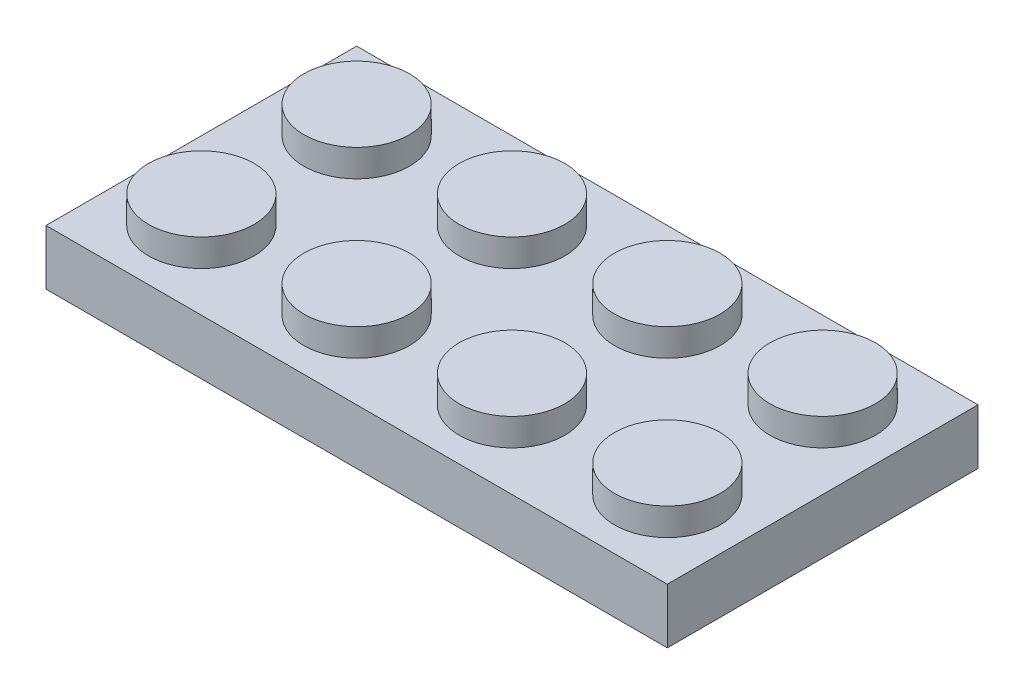
ISO-10303-21;
HEADER;
FILE_DESCRIPTION(('STEP AP214'),'2;1');
FILE_NAME('part.step','',(''),(''),'','','');
FILE_SCHEMA(('AUTOMOTIVE_DESIGN { 1 0 10303 214 1 1 1 1 }'));
ENDSEC;
DATA;
#1=APPLICATION_CONTEXT('core data for automotive mechanical design processes');
#2=APPLICATION_PROTOCOL_DEFINITION('international standard','automotive_design',2000,#1);
#3=PRODUCT_CONTEXT('',#1,'mechanical');
#4=PRODUCT('Part','Part','',(#3));
#5=PRODUCT_RELATED_PRODUCT_CATEGORY('part','',(#4));
#6=PRODUCT_DEFINITION_FORMATION('','',#4);
#7=PRODUCT_DEFINITION_CONTEXT('part definition',#1,'design');
#8=PRODUCT_DEFINITION('design','',#6,#7);
#9=PRODUCT_DEFINITION_SHAPE('','',#8);
#10=(LENGTH_UNIT() NAMED_UNIT(*) SI_UNIT(.MILLI.,.METRE.));
#11=(NAMED_UNIT(*) PLANE_ANGLE_UNIT() SI_UNIT($,.RADIAN.));
#12=(NAMED_UNIT(*) SI_UNIT($,.STERADIAN.) SOLID_ANGLE_UNIT());
#13=UNCERTAINTY_MEASURE_WITH_UNIT(LENGTH_MEASURE(1.E-05),#10,'distance_accuracy_value','');
#14=(GEOMETRIC_REPRESENTATION_CONTEXT(3) GLOBAL_UNCERTAINTY_ASSIGNED_CONTEXT((#13)) GLOBAL_UNIT_ASSIGNED_CONTEXT((#10,
#11,#12)) REPRESENTATION_CONTEXT('',''));
#15=CARTESIAN_POINT('',(0.,0.,0.));
#16=DIRECTION('',(0.,0.,1.));
#17=DIRECTION('',(1.,0.,0.));
#18=AXIS2_PLACEMENT_3D('',#15,#16,#17);
#19=CARTESIAN_POINT('',(-15.875,1.4097,7.9375));
#20=DIRECTION('',(0.,-1.,0.));
#21=DIRECTION('',(0.,0.,-1.));
#22=AXIS2_PLACEMENT_3D('',#19,#20,#21);
#23=PLANE('',#22);
#24=CARTESIAN_POINT('',(11.90625,1.4097,3.96875));
#25=DIRECTION('',(0.,-1.,0.));
#26=DIRECTION('',(0.,0.,-1.));
#27=AXIS2_PLACEMENT_3D('',#24,#25,#26);
#28=CIRCLE('',#27,2.69875);
#29=CARTESIAN_POINT('',(11.90625,1.4097,1.27));
#30=VERTEX_POINT('',#29);
#31=EDGE_CURVE('E194',#30,#30,#28,.F.);
#32=ORIENTED_EDGE('',*,*,#31,.F.);
#33=EDGE_LOOP('',(#32));
#34=FACE_BOUND('',#33,.T.);
#35=DIRECTION('',(0.,0.,1.));
#36=VECTOR('',#35,1.);
#37=CARTESIAN_POINT('',(-15.875,1.4097,-7.9375));
#38=LINE('',#37,#36);
#39=CARTESIAN_POINT('',(-15.875,1.4097,-7.9375));
#40=VERTEX_POINT('',#39);
#41=CARTESIAN_POINT('',(-15.875,1.4097,7.9375));
#42=VERTEX_POINT('',#41);
#43=EDGE_CURVE('E172',#40,#42,#38,.T.);
#44=ORIENTED_EDGE('',*,*,#43,.T.);
#45=DIRECTION('',(1.,0.,0.));
#46=VECTOR('',#45,1.);
#47=CARTESIAN_POINT('',(15.875,1.4097,7.9375));
#48=LINE('',#47,#46);
#49=CARTESIAN_POINT('',(15.875,1.4097,7.9375));
#50=VERTEX_POINT('',#49);
#51=EDGE_CURVE('E114',#42,#50,#48,.T.);
#52=ORIENTED_EDGE('',*,*,#51,.T.);
#53=DIRECTION('',(0.,0.,-1.));
#54=VECTOR('',#53,1.);
#55=CARTESIAN_POINT('',(15.875,1.4097,-7.9375));
#56=LINE('',#55,#54);
#57=CARTESIAN_POINT('',(15.875,1.4097,-7.9375));
#58=VERTEX_POINT('',#57);
#59=EDGE_CURVE('E175',#50,#58,#56,.T.);
#60=ORIENTED_EDGE('',*,*,#59,.T.);
#61=DIRECTION('',(-1.,0.,0.));
#62=VECTOR('',#61,1.);
#63=CARTESIAN_POINT('',(15.875,1.4097,-7.9375));
#64=LINE('',#63,#62);
#65=EDGE_CURVE('E85',#58,#40,#64,.T.);
#66=ORIENTED_EDGE('',*,*,#65,.T.);
#67=EDGE_LOOP('',(#44,#52,#60,#66));
#68=FACE_BOUND('',#67,.T.);
#69=CARTESIAN_POINT('',(3.96875,1.4097,3.96875000000001));
#70=DIRECTION('',(0.,-1.,0.));
#71=DIRECTION('',(0.,0.,-1.));
#72=AXIS2_PLACEMENT_3D('',#69,#70,#71);
#73=CIRCLE('',#72,2.69875);
#74=CARTESIAN_POINT('',(3.96875,1.4097,1.27000000000001));
#75=VERTEX_POINT('',#74);
#76=EDGE_CURVE('E197',#75,#75,#73,.F.);
#77=ORIENTED_EDGE('',*,*,#76,.F.);
#78=EDGE_LOOP('',(#77));
#79=FACE_BOUND('',#78,.T.);
#80=CARTESIAN_POINT('',(-3.96875,1.4097,3.96875000000001));
#81=DIRECTION('',(0.,-1.,0.));
#82=DIRECTION('',(0.,0.,-1.));
#83=AXIS2_PLACEMENT_3D('',#80,#81,#82);
#84=CIRCLE('',#83,2.69875);
#85=CARTESIAN_POINT('',(-3.96875,1.4097,1.27000000000001));
#86=VERTEX_POINT('',#85);
#87=EDGE_CURVE('E200',#86,#86,#84,.F.);
#88=ORIENTED_EDGE('',*,*,#87,.F.);
#89=EDGE_LOOP('',(#88));
#90=FACE_BOUND('',#89,.T.);
#91=CARTESIAN_POINT('',(-11.90625,1.4097,3.96875000000001));
#92=DIRECTION('',(0.,-1.,0.));
#93=DIRECTION('',(0.,0.,-1.));
#94=AXIS2_PLACEMENT_3D('',#91,#92,#93);
#95=CIRCLE('',#94,2.69875);
#96=CARTESIAN_POINT('',(-11.90625,1.4097,1.27000000000001));
#97=VERTEX_POINT('',#96);
#98=EDGE_CURVE('E206',#97,#97,#95,.F.);
#99=ORIENTED_EDGE('',*,*,#98,.F.);
#100=EDGE_LOOP('',(#99));
#101=FACE_BOUND('',#100,.T.);
#102=CARTESIAN_POINT('',(11.90625,1.4097,-3.96875));
#103=DIRECTION('',(0.,-1.,0.));
#104=DIRECTION('',(0.,0.,-1.));
#105=AXIS2_PLACEMENT_3D('',#102,#103,#104);
#106=CIRCLE('',#105,2.69875);
#107=CARTESIAN_POINT('',(11.90625,1.4097,-6.6675));
#108=VERTEX_POINT('',#107);
#109=EDGE_CURVE('E212',#108,#108,#106,.F.);
#110=ORIENTED_EDGE('',*,*,#109,.F.);
#111=EDGE_LOOP('',(#110));
#112=FACE_BOUND('',#111,.T.);
#113=CARTESIAN_POINT('',(3.96875,1.4097,-3.96874999999999));
#114=DIRECTION('',(0.,-1.,0.));
#115=DIRECTION('',(0.,0.,-1.));
#116=AXIS2_PLACEMENT_3D('',#113,#114,#115);
#117=CIRCLE('',#116,2.69875);
#118=CARTESIAN_POINT('',(3.96875,1.4097,-6.66749999999999));
#119=VERTEX_POINT('',#118);
#120=EDGE_CURVE('E218',#119,#119,#117,.F.);
#121=ORIENTED_EDGE('',*,*,#120,.F.);
#122=EDGE_LOOP('',(#121));
#123=FACE_BOUND('',#122,.T.);
#124=CARTESIAN_POINT('',(-3.96875,1.4097,-3.96874999999999));
#125=DIRECTION('',(0.,-1.,0.));
#126=DIRECTION('',(0.,0.,-1.));
#127=AXIS2_PLACEMENT_3D('',#124,#125,#126);
#128=CIRCLE('',#127,2.69875);
#129=CARTESIAN_POINT('',(-3.96875,1.4097,-6.66749999999999));
#130=VERTEX_POINT('',#129);
#131=EDGE_CURVE('E224',#130,#130,#128,.F.);
#132=ORIENTED_EDGE('',*,*,#131,.F.);
#133=EDGE_LOOP('',(#132));
#134=FACE_BOUND('',#133,.T.);
#135=CARTESIAN_POINT('',(-11.90625,1.4097,-3.96874999999999));
#136=DIRECTION('',(0.,-1.,0.));
#137=DIRECTION('',(0.,0.,-1.));
#138=AXIS2_PLACEMENT_3D('',#135,#136,#137);
#139=CIRCLE('',#138,2.69875);
#140=CARTESIAN_POINT('',(-11.90625,1.4097,-6.66749999999999));
#141=VERTEX_POINT('',#140);
#142=EDGE_CURVE('E230',#141,#141,#139,.F.);
#143=ORIENTED_EDGE('',*,*,#142,.F.);
#144=EDGE_LOOP('',(#143));
#145=FACE_BOUND('',#144,.T.);
#146=ADVANCED_FACE('F61',(#34,#68,#79,#90,#101,#112,#123,#134,#145),#23,.F.);
#147=CARTESIAN_POINT('',(-15.875,1.4097,-7.9375));
#148=DIRECTION('',(1.,0.,0.));
#149=DIRECTION('',(0.,0.,-1.));
#150=AXIS2_PLACEMENT_3D('',#147,#148,#149);
#151=PLANE('',#150);
#152=DIRECTION('',(0.,0.,1.));
#153=VECTOR('',#152,1.);
#154=CARTESIAN_POINT('',(-15.875,-1.4097,-7.9375));
#155=LINE('',#154,#153);
#156=CARTESIAN_POINT('',(-15.875,-1.4097,-7.9375));
#157=VERTEX_POINT('',#156);
#158=CARTESIAN_POINT('',(-15.875,-1.4097,7.9375));
#159=VERTEX_POINT('',#158);
#160=EDGE_CURVE('E170',#157,#159,#155,.T.);
#161=ORIENTED_EDGE('',*,*,#160,.T.);
#162=DIRECTION('',(0.,-1.,0.));
#163=VECTOR('',#162,1.);
#164=CARTESIAN_POINT('',(-15.875,1.4097,7.9375));
#165=LINE('',#164,#163);
#166=EDGE_CURVE('E192',#42,#159,#165,.T.);
#167=ORIENTED_EDGE('',*,*,#166,.F.);
#168=ORIENTED_EDGE('',*,*,#43,.F.);
#169=DIRECTION('',(0.,-1.,0.));
#170=VECTOR('',#169,1.);
#171=CARTESIAN_POINT('',(-15.875,1.4097,-7.9375));
#172=LINE('',#171,#170);
#173=EDGE_CURVE('E178',#40,#157,#172,.T.);
#174=ORIENTED_EDGE('',*,*,#173,.T.);
#175=EDGE_LOOP('',(#161,#167,#168,#174));
#176=FACE_BOUND('',#175,.T.);
#177=ADVANCED_FACE('F274',(#176),#151,.F.);
#178=CARTESIAN_POINT('',(15.875,1.4097,7.9375));
#179=DIRECTION('',(0.,0.,-1.));
#180=DIRECTION('',(-1.,0.,0.));
#181=AXIS2_PLACEMENT_3D('',#178,#179,#180);
#182=PLANE('',#181);
#183=DIRECTION('',(1.,0.,0.));
#184=VECTOR('',#183,1.);
#185=CARTESIAN_POINT('',(15.875,-1.4097,7.9375));
#186=LINE('',#185,#184);
#187=CARTESIAN_POINT('',(15.875,-1.4097,7.9375));
#188=VERTEX_POINT('',#187);
#189=EDGE_CURVE('E181',#159,#188,#186,.T.);
#190=ORIENTED_EDGE('',*,*,#189,.T.);
#191=DIRECTION('',(0.,-1.,0.));
#192=VECTOR('',#191,1.);
#193=CARTESIAN_POINT('',(15.875,1.4097,7.9375));
#194=LINE('',#193,#192);
#195=EDGE_CURVE('E189',#50,#188,#194,.T.);
#196=ORIENTED_EDGE('',*,*,#195,.F.);
#197=ORIENTED_EDGE('',*,*,#51,.F.);
#198=ORIENTED_EDGE('',*,*,#166,.T.);
#199=EDGE_LOOP('',(#190,#196,#197,#198));
#200=FACE_BOUND('',#199,.T.);
#201=ADVANCED_FACE('F279',(#200),#182,.F.);
#202=CARTESIAN_POINT('',(15.875,1.4097,-7.9375));
#203=DIRECTION('',(-1.,0.,0.));
#204=DIRECTION('',(0.,0.,1.));
#205=AXIS2_PLACEMENT_3D('',#202,#203,#204);
#206=PLANE('',#205);
#207=DIRECTION('',(0.,0.,-1.));
#208=VECTOR('',#207,1.);
#209=CARTESIAN_POINT('',(15.875,-1.4097,-7.9375));
#210=LINE('',#209,#208);
#211=CARTESIAN_POINT('',(15.875,-1.4097,-7.9375));
#212=VERTEX_POINT('',#211);
#213=EDGE_CURVE('E183',#188,#212,#210,.T.);
#214=ORIENTED_EDGE('',*,*,#213,.T.);
#215=DIRECTION('',(0.,-1.,0.));
#216=VECTOR('',#215,1.);
#217=CARTESIAN_POINT('',(15.875,1.4097,-7.9375));
#218=LINE('',#217,#216);
#219=EDGE_CURVE('E187',#58,#212,#218,.T.);
#220=ORIENTED_EDGE('',*,*,#219,.F.);
#221=ORIENTED_EDGE('',*,*,#59,.F.);
#222=ORIENTED_EDGE('',*,*,#195,.T.);
#223=EDGE_LOOP('',(#214,#220,#221,#222));
#224=FACE_BOUND('',#223,.T.);
#225=ADVANCED_FACE('F286',(#224),#206,.F.);
#226=CARTESIAN_POINT('',(15.875,1.4097,-7.9375));
#227=DIRECTION('',(0.,0.,1.));
#228=DIRECTION('',(1.,0.,0.));
#229=AXIS2_PLACEMENT_3D('',#226,#227,#228);
#230=PLANE('',#229);
#231=DIRECTION('',(-1.,0.,0.));
#232=VECTOR('',#231,1.);
#233=CARTESIAN_POINT('',(15.875,-1.4097,-7.9375));
#234=LINE('',#233,#232);
#235=EDGE_CURVE('E106',#212,#157,#234,.T.);
#236=ORIENTED_EDGE('',*,*,#235,.T.);
#237=ORIENTED_EDGE('',*,*,#173,.F.);
#238=ORIENTED_EDGE('',*,*,#65,.F.);
#239=ORIENTED_EDGE('',*,*,#219,.T.);
#240=EDGE_LOOP('',(#236,#237,#238,#239));
#241=FACE_BOUND('',#240,.T.);
#242=ADVANCED_FACE('F269',(#241),#230,.F.);
#243=CARTESIAN_POINT('',(-15.875,-1.4097,7.9375));
#244=DIRECTION('',(0.,-1.,0.));
#245=DIRECTION('',(0.,0.,-1.));
#246=AXIS2_PLACEMENT_3D('',#243,#244,#245);
#247=PLANE('',#246);
#248=DIRECTION('',(0.,0.,1.));
#249=VECTOR('',#248,1.);
#250=CARTESIAN_POINT('',(14.605,-1.4097,-27.7520581765825));
#251=LINE('',#250,#249);
#252=CARTESIAN_POINT('',(14.605,-1.4097,-6.6675));
#253=VERTEX_POINT('',#252);
#254=CARTESIAN_POINT('',(14.605,-1.4097,6.6675));
#255=VERTEX_POINT('',#254);
#256=EDGE_CURVE('E76',#253,#255,#251,.T.);
#257=ORIENTED_EDGE('',*,*,#256,.F.);
#258=DIRECTION('',(1.,0.,0.));
#259=VECTOR('',#258,1.);
#260=CARTESIAN_POINT('',(0.,-1.4097,-6.6675));
#261=LINE('',#260,#259);
#262=CARTESIAN_POINT('',(-14.605,-1.4097,-6.6675));
#263=VERTEX_POINT('',#262);
#264=EDGE_CURVE('E159',#263,#253,#261,.T.);
#265=ORIENTED_EDGE('',*,*,#264,.F.);
#266=DIRECTION('',(0.,0.,-1.));
#267=VECTOR('',#266,1.);
#268=CARTESIAN_POINT('',(-14.605,-1.4097,-27.7520581765825));
#269=LINE('',#268,#267);
#270=CARTESIAN_POINT('',(-14.605,-1.4097,6.6675));
#271=VERTEX_POINT('',#270);
#272=EDGE_CURVE('E142',#271,#263,#269,.T.);
#273=ORIENTED_EDGE('',*,*,#272,.F.);
#274=DIRECTION('',(-1.,0.,0.));
#275=VECTOR('',#274,1.);
#276=CARTESIAN_POINT('',(0.,-1.4097,6.6675));
#277=LINE('',#276,#275);
#278=EDGE_CURVE('E152',#255,#271,#277,.T.);
#279=ORIENTED_EDGE('',*,*,#278,.F.);
#280=EDGE_LOOP('',(#257,#265,#273,#279));
#281=FACE_BOUND('',#280,.T.);
#282=ORIENTED_EDGE('',*,*,#160,.F.);
#283=ORIENTED_EDGE('',*,*,#235,.F.);
#284=ORIENTED_EDGE('',*,*,#213,.F.);
#285=ORIENTED_EDGE('',*,*,#189,.F.);
#286=EDGE_LOOP('',(#282,#283,#284,#285));
#287=FACE_BOUND('',#286,.T.);
#288=ADVANCED_FACE('F156',(#281,#287),#247,.T.);
#289=CARTESIAN_POINT('',(14.605,33.5196100746171,-27.7520581765825));
#290=DIRECTION('',(1.,0.,0.));
#291=DIRECTION('',(0.,0.,-1.));
#292=AXIS2_PLACEMENT_3D('',#289,#290,#291);
#293=PLANE('',#292);
#294=DIRECTION('',(0.,0.,-1.));
#295=VECTOR('',#294,1.);
#296=CARTESIAN_POINT('',(14.605,0.1397,-27.7520581765825));
#297=LINE('',#296,#295);
#298=CARTESIAN_POINT('',(14.605,0.1397,6.6675));
#299=VERTEX_POINT('',#298);
#300=CARTESIAN_POINT('',(14.605,0.1397,-6.6675));
#301=VERTEX_POINT('',#300);
#302=EDGE_CURVE('E171',#299,#301,#297,.T.);
#303=ORIENTED_EDGE('',*,*,#302,.T.);
#304=DIRECTION('',(0.,-1.,0.));
#305=VECTOR('',#304,1.);
#306=CARTESIAN_POINT('',(14.605,33.5196100746171,-6.6675));
#307=LINE('',#306,#305);
#308=EDGE_CURVE('E164',#301,#253,#307,.T.);
#309=ORIENTED_EDGE('',*,*,#308,.T.);
#310=ORIENTED_EDGE('',*,*,#256,.T.);
#311=DIRECTION('',(0.,-1.,0.));
#312=VECTOR('',#311,1.);
#313=CARTESIAN_POINT('',(14.605,33.5196100746171,6.66749999999999));
#314=LINE('',#313,#312);
#315=EDGE_CURVE('E149',#299,#255,#314,.T.);
#316=ORIENTED_EDGE('',*,*,#315,.F.);
#317=EDGE_LOOP('',(#303,#309,#310,#316));
#318=FACE_BOUND('',#317,.T.);
#319=ADVANCED_FACE('F259',(#318),#293,.F.);
#320=CARTESIAN_POINT('',(0.,33.5196100746171,-6.6675));
#321=DIRECTION('',(0.,0.,-1.));
#322=DIRECTION('',(-1.,0.,0.));
#323=AXIS2_PLACEMENT_3D('',#320,#321,#322);
#324=PLANE('',#323);
#325=DIRECTION('',(-1.,0.,0.));
#326=VECTOR('',#325,1.);
#327=CARTESIAN_POINT('',(0.,0.1397,-6.6675));
#328=LINE('',#327,#326);
#329=CARTESIAN_POINT('',(-14.605,0.1397,-6.6675));
#330=VERTEX_POINT('',#329);
#331=EDGE_CURVE('E256',#301,#330,#328,.T.);
#332=ORIENTED_EDGE('',*,*,#331,.T.);
#333=DIRECTION('',(0.,-1.,0.));
#334=VECTOR('',#333,1.);
#335=CARTESIAN_POINT('',(-14.605,33.5196100746171,-6.6675));
#336=LINE('',#335,#334);
#337=EDGE_CURVE('E148',#330,#263,#336,.T.);
#338=ORIENTED_EDGE('',*,*,#337,.T.);
#339=ORIENTED_EDGE('',*,*,#264,.T.);
#340=ORIENTED_EDGE('',*,*,#308,.F.);
#341=EDGE_LOOP('',(#332,#338,#339,#340));
#342=FACE_BOUND('',#341,.T.);
#343=ADVANCED_FACE('F261',(#342),#324,.F.);
#344=CARTESIAN_POINT('',(-14.605,33.5196100746171,-27.7520581765825));
#345=DIRECTION('',(-1.,0.,0.));
#346=DIRECTION('',(0.,0.,1.));
#347=AXIS2_PLACEMENT_3D('',#344,#345,#346);
#348=PLANE('',#347);
#349=DIRECTION('',(0.,0.,1.));
#350=VECTOR('',#349,1.);
#351=CARTESIAN_POINT('',(-14.605,0.1397,-27.7520581765825));
#352=LINE('',#351,#350);
#353=CARTESIAN_POINT('',(-14.605,0.1397,6.6675));
#354=VERTEX_POINT('',#353);
#355=EDGE_CURVE('E145',#330,#354,#352,.T.);
#356=ORIENTED_EDGE('',*,*,#355,.T.);
#357=DIRECTION('',(0.,-1.,0.));
#358=VECTOR('',#357,1.);
#359=CARTESIAN_POINT('',(-14.605,33.5196100746171,6.6675));
#360=LINE('',#359,#358);
#361=EDGE_CURVE('E137',#354,#271,#360,.T.);
#362=ORIENTED_EDGE('',*,*,#361,.T.);
#363=ORIENTED_EDGE('',*,*,#272,.T.);
#364=ORIENTED_EDGE('',*,*,#337,.F.);
#365=EDGE_LOOP('',(#356,#362,#363,#364));
#366=FACE_BOUND('',#365,.T.);
#367=ADVANCED_FACE('F139',(#366),#348,.F.);
#368=CARTESIAN_POINT('',(0.,33.5196100746171,6.6675));
#369=DIRECTION('',(0.,0.,1.));
#370=DIRECTION('',(1.,0.,0.));
#371=AXIS2_PLACEMENT_3D('',#368,#369,#370);
#372=PLANE('',#371);
#373=DIRECTION('',(1.,0.,0.));
#374=VECTOR('',#373,1.);
#375=CARTESIAN_POINT('',(0.,0.1397,6.6675));
#376=LINE('',#375,#374);
#377=EDGE_CURVE('E168',#354,#299,#376,.T.);
#378=ORIENTED_EDGE('',*,*,#377,.T.);
#379=ORIENTED_EDGE('',*,*,#315,.T.);
#380=ORIENTED_EDGE('',*,*,#278,.T.);
#381=ORIENTED_EDGE('',*,*,#361,.F.);
#382=EDGE_LOOP('',(#378,#379,#380,#381));
#383=FACE_BOUND('',#382,.T.);
#384=ADVANCED_FACE('F153',(#383),#372,.F.);
#385=CARTESIAN_POINT('',(-15.875,0.1397,7.9375));
#386=DIRECTION('',(0.,-1.,0.));
#387=DIRECTION('',(0.,0.,-1.));
#388=AXIS2_PLACEMENT_3D('',#385,#386,#387);
#389=PLANE('',#388);
#390=CARTESIAN_POINT('',(7.9375,0.1397,0.));
#391=DIRECTION('',(0.,-1.,0.));
#392=DIRECTION('',(0.,0.,-1.));
#393=AXIS2_PLACEMENT_3D('',#390,#391,#392);
#394=CIRCLE('',#393,3.175);
#395=CARTESIAN_POINT('',(7.9375,0.1397,-3.175));
#396=VERTEX_POINT('',#395);
#397=EDGE_CURVE('E13',#396,#396,#394,.T.);
#398=ORIENTED_EDGE('',*,*,#397,.F.);
#399=EDGE_LOOP('',(#398));
#400=FACE_BOUND('',#399,.T.);
#401=CARTESIAN_POINT('',(-7.9375,0.1397,0.));
#402=DIRECTION('',(0.,-1.,0.));
#403=DIRECTION('',(0.,0.,-1.));
#404=AXIS2_PLACEMENT_3D('',#401,#402,#403);
#405=CIRCLE('',#404,3.175);
#406=CARTESIAN_POINT('',(-7.9375,0.1397,-3.175));
#407=VERTEX_POINT('',#406);
#408=EDGE_CURVE('E69',#407,#407,#405,.T.);
#409=ORIENTED_EDGE('',*,*,#408,.F.);
#410=EDGE_LOOP('',(#409));
#411=FACE_BOUND('',#410,.T.);
#412=CARTESIAN_POINT('',(0.,0.1397,0.));
#413=DIRECTION('',(0.,-1.,0.));
#414=DIRECTION('',(0.,0.,-1.));
#415=AXIS2_PLACEMENT_3D('',#412,#413,#414);
#416=CIRCLE('',#415,3.175);
#417=CARTESIAN_POINT('',(0.,0.1397,-3.175));
#418=VERTEX_POINT('',#417);
#419=EDGE_CURVE('E236',#418,#418,#416,.T.);
#420=ORIENTED_EDGE('',*,*,#419,.F.);
#421=EDGE_LOOP('',(#420));
#422=FACE_BOUND('',#421,.T.);
#423=ORIENTED_EDGE('',*,*,#302,.F.);
#424=ORIENTED_EDGE('',*,*,#377,.F.);
#425=ORIENTED_EDGE('',*,*,#355,.F.);
#426=ORIENTED_EDGE('',*,*,#331,.F.);
#427=EDGE_LOOP('',(#423,#424,#425,#426));
#428=FACE_BOUND('',#427,.T.);
#429=ADVANCED_FACE('F244',(#400,#411,#422,#428),#389,.T.);
#430=CARTESIAN_POINT('',(11.90625,2.8067,3.96875));
#431=DIRECTION('',(0.,-1.,0.));
#432=DIRECTION('',(0.,0.,-1.));
#433=AXIS2_PLACEMENT_3D('',#430,#431,#432);
#434=CYLINDRICAL_SURFACE('',#433,2.69875);
#435=CARTESIAN_POINT('',(11.90625,2.8067,3.96875));
#436=DIRECTION('',(0.,1.,0.));
#437=DIRECTION('',(0.,0.,1.));
#438=AXIS2_PLACEMENT_3D('',#435,#436,#437);
#439=CIRCLE('',#438,2.69875);
#440=CARTESIAN_POINT('',(11.90625,2.8067,6.6675));
#441=VERTEX_POINT('',#440);
#442=EDGE_CURVE('E663',#441,#441,#439,.T.);
#443=ORIENTED_EDGE('',*,*,#442,.F.);
#444=EDGE_LOOP('',(#443));
#445=FACE_BOUND('',#444,.T.);
#446=ORIENTED_EDGE('',*,*,#31,.T.);
#447=EDGE_LOOP('',(#446));
#448=FACE_BOUND('',#447,.T.);
#449=ADVANCED_FACE('F247',(#445,#448),#434,.T.);
#450=CARTESIAN_POINT('',(11.90625,2.8067,3.96875));
#451=DIRECTION('',(0.,1.,0.));
#452=DIRECTION('',(0.,0.,1.));
#453=AXIS2_PLACEMENT_3D('',#450,#451,#452);
#454=PLANE('',#453);
#455=ORIENTED_EDGE('',*,*,#442,.T.);
#456=EDGE_LOOP('',(#455));
#457=FACE_BOUND('',#456,.T.);
#458=ADVANCED_FACE('F404',(#457),#454,.T.);
#459=CARTESIAN_POINT('',(3.96875,2.8067,3.96875000000001));
#460=DIRECTION('',(0.,-1.,0.));
#461=DIRECTION('',(0.,0.,-1.));
#462=AXIS2_PLACEMENT_3D('',#459,#460,#461);
#463=CYLINDRICAL_SURFACE('',#462,2.69875);
#464=CARTESIAN_POINT('',(3.96875,2.8067,3.96875000000001));
#465=DIRECTION('',(0.,1.,0.));
#466=DIRECTION('',(0.,0.,1.));
#467=AXIS2_PLACEMENT_3D('',#464,#465,#466);
#468=CIRCLE('',#467,2.69875);
#469=CARTESIAN_POINT('',(3.96875,2.8067,6.6675));
#470=VERTEX_POINT('',#469);
#471=EDGE_CURVE('E660',#470,#470,#468,.T.);
#472=ORIENTED_EDGE('',*,*,#471,.F.);
#473=EDGE_LOOP('',(#472));
#474=FACE_BOUND('',#473,.T.);
#475=ORIENTED_EDGE('',*,*,#76,.T.);
#476=EDGE_LOOP('',(#475));
#477=FACE_BOUND('',#476,.T.);
#478=ADVANCED_FACE('F396',(#474,#477),#463,.T.);
#479=CARTESIAN_POINT('',(3.96875,2.8067,3.96875000000001));
#480=DIRECTION('',(0.,1.,0.));
#481=DIRECTION('',(0.,0.,1.));
#482=AXIS2_PLACEMENT_3D('',#479,#480,#481);
#483=PLANE('',#482);
#484=ORIENTED_EDGE('',*,*,#471,.T.);
#485=EDGE_LOOP('',(#484));
#486=FACE_BOUND('',#485,.T.);
#487=ADVANCED_FACE('F300',(#486),#483,.T.);
#488=CARTESIAN_POINT('',(-3.96875,2.8067,3.96875000000001));
#489=DIRECTION('',(0.,1.,0.));
#490=DIRECTION('',(0.,0.,1.));
#491=AXIS2_PLACEMENT_3D('',#488,#489,#490);
#492=PLANE('',#491);
#493=CARTESIAN_POINT('',(-3.96875,2.8067,3.96875000000001));
#494=DIRECTION('',(0.,1.,0.));
#495=DIRECTION('',(0.,0.,1.));
#496=AXIS2_PLACEMENT_3D('',#493,#494,#495);
#497=CIRCLE('',#496,2.69875);
#498=CARTESIAN_POINT('',(-3.96875,2.8067,6.66750000000001));
#499=VERTEX_POINT('',#498);
#500=EDGE_CURVE('E203',#499,#499,#497,.T.);
#501=ORIENTED_EDGE('',*,*,#500,.T.);
#502=EDGE_LOOP('',(#501));
#503=FACE_BOUND('',#502,.T.);
#504=ADVANCED_FACE('F296',(#503),#492,.T.);
#505=CARTESIAN_POINT('',(-3.96875,2.8067,3.96875000000001));
#506=DIRECTION('',(0.,-1.,0.));
#507=DIRECTION('',(0.,0.,-1.));
#508=AXIS2_PLACEMENT_3D('',#505,#506,#507);
#509=CYLINDRICAL_SURFACE('',#508,2.69875);
#510=ORIENTED_EDGE('',*,*,#500,.F.);
#511=EDGE_LOOP('',(#510));
#512=FACE_BOUND('',#511,.T.);
#513=ORIENTED_EDGE('',*,*,#87,.T.);
#514=EDGE_LOOP('',(#513));
#515=FACE_BOUND('',#514,.T.);
#516=ADVANCED_FACE('F292',(#512,#515),#509,.T.);
#517=CARTESIAN_POINT('',(-11.90625,2.8067,3.96875000000001));
#518=DIRECTION('',(0.,1.,0.));
#519=DIRECTION('',(0.,0.,1.));
#520=AXIS2_PLACEMENT_3D('',#517,#518,#519);
#521=PLANE('',#520);
#522=CARTESIAN_POINT('',(-11.90625,2.8067,3.96875000000001));
#523=DIRECTION('',(0.,1.,0.));
#524=DIRECTION('',(0.,0.,1.));
#525=AXIS2_PLACEMENT_3D('',#522,#523,#524);
#526=CIRCLE('',#525,2.69875);
#527=CARTESIAN_POINT('',(-11.90625,2.8067,6.66750000000001));
#528=VERTEX_POINT('',#527);
#529=EDGE_CURVE('E209',#528,#528,#526,.T.);
#530=ORIENTED_EDGE('',*,*,#529,.T.);
#531=EDGE_LOOP('',(#530));
#532=FACE_BOUND('',#531,.T.);
#533=ADVANCED_FACE('F295',(#532),#521,.T.);
#534=CARTESIAN_POINT('',(-11.90625,2.8067,3.96875000000001));
#535=DIRECTION('',(0.,-1.,0.));
#536=DIRECTION('',(0.,0.,-1.));
#537=AXIS2_PLACEMENT_3D('',#534,#535,#536);
#538=CYLINDRICAL_SURFACE('',#537,2.69875);
#539=ORIENTED_EDGE('',*,*,#529,.F.);
#540=EDGE_LOOP('',(#539));
#541=FACE_BOUND('',#540,.T.);
#542=ORIENTED_EDGE('',*,*,#98,.T.);
#543=EDGE_LOOP('',(#542));
#544=FACE_BOUND('',#543,.T.);
#545=ADVANCED_FACE('F302',(#541,#544),#538,.T.);
#546=CARTESIAN_POINT('',(11.90625,2.8067,-3.96875));
#547=DIRECTION('',(0.,1.,0.));
#548=DIRECTION('',(0.,0.,1.));
#549=AXIS2_PLACEMENT_3D('',#546,#547,#548);
#550=PLANE('',#549);
#551=CARTESIAN_POINT('',(11.90625,2.8067,-3.96875));
#552=DIRECTION('',(0.,1.,0.));
#553=DIRECTION('',(0.,0.,1.));
#554=AXIS2_PLACEMENT_3D('',#551,#552,#553);
#555=CIRCLE('',#554,2.69875);
#556=CARTESIAN_POINT('',(11.90625,2.8067,-1.27));
#557=VERTEX_POINT('',#556);
#558=EDGE_CURVE('E215',#557,#557,#555,.T.);
#559=ORIENTED_EDGE('',*,*,#558,.T.);
#560=EDGE_LOOP('',(#559));
#561=FACE_BOUND('',#560,.T.);
#562=ADVANCED_FACE('F305',(#561),#550,.T.);
#563=CARTESIAN_POINT('',(11.90625,2.8067,-3.96875));
#564=DIRECTION('',(0.,-1.,0.));
#565=DIRECTION('',(0.,0.,-1.));
#566=AXIS2_PLACEMENT_3D('',#563,#564,#565);
#567=CYLINDRICAL_SURFACE('',#566,2.69875);
#568=ORIENTED_EDGE('',*,*,#558,.F.);
#569=EDGE_LOOP('',(#568));
#570=FACE_BOUND('',#569,.T.);
#571=ORIENTED_EDGE('',*,*,#109,.T.);
#572=EDGE_LOOP('',(#571));
#573=FACE_BOUND('',#572,.T.);
#574=ADVANCED_FACE('F310',(#570,#573),#567,.T.);
#575=CARTESIAN_POINT('',(3.96875,2.8067,-3.96874999999999));
#576=DIRECTION('',(0.,1.,0.));
#577=DIRECTION('',(0.,0.,1.));
#578=AXIS2_PLACEMENT_3D('',#575,#576,#577);
#579=PLANE('',#578);
#580=CARTESIAN_POINT('',(3.96875,2.8067,-3.96874999999999));
#581=DIRECTION('',(0.,1.,0.));
#582=DIRECTION('',(0.,0.,1.));
#583=AXIS2_PLACEMENT_3D('',#580,#581,#582);
#584=CIRCLE('',#583,2.69875);
#585=CARTESIAN_POINT('',(3.96875,2.8067,-1.27));
#586=VERTEX_POINT('',#585);
#587=EDGE_CURVE('E221',#586,#586,#584,.T.);
#588=ORIENTED_EDGE('',*,*,#587,.T.);
#589=EDGE_LOOP('',(#588));
#590=FACE_BOUND('',#589,.T.);
#591=ADVANCED_FACE('F313',(#590),#579,.T.);
#592=CARTESIAN_POINT('',(3.96875,2.8067,-3.96874999999999));
#593=DIRECTION('',(0.,-1.,0.));
#594=DIRECTION('',(0.,0.,-1.));
#595=AXIS2_PLACEMENT_3D('',#592,#593,#594);
#596=CYLINDRICAL_SURFACE('',#595,2.69875);
#597=ORIENTED_EDGE('',*,*,#587,.F.);
#598=EDGE_LOOP('',(#597));
#599=FACE_BOUND('',#598,.T.);
#600=ORIENTED_EDGE('',*,*,#120,.T.);
#601=EDGE_LOOP('',(#600));
#602=FACE_BOUND('',#601,.T.);
#603=ADVANCED_FACE('F318',(#599,#602),#596,.T.);
#604=CARTESIAN_POINT('',(-3.96875,2.8067,-3.96874999999999));
#605=DIRECTION('',(0.,1.,0.));
#606=DIRECTION('',(0.,0.,1.));
#607=AXIS2_PLACEMENT_3D('',#604,#605,#606);
#608=PLANE('',#607);
#609=CARTESIAN_POINT('',(-3.96875,2.8067,-3.96874999999999));
#610=DIRECTION('',(0.,1.,0.));
#611=DIRECTION('',(0.,0.,1.));
#612=AXIS2_PLACEMENT_3D('',#609,#610,#611);
#613=CIRCLE('',#612,2.69875);
#614=CARTESIAN_POINT('',(-3.96875,2.8067,-1.26999999999999));
#615=VERTEX_POINT('',#614);
#616=EDGE_CURVE('E227',#615,#615,#613,.T.);
#617=ORIENTED_EDGE('',*,*,#616,.T.);
#618=EDGE_LOOP('',(#617));
#619=FACE_BOUND('',#618,.T.);
#620=ADVANCED_FACE('F321',(#619),#608,.T.);
#621=CARTESIAN_POINT('',(-3.96875,2.8067,-3.96874999999999));
#622=DIRECTION('',(0.,-1.,0.));
#623=DIRECTION('',(0.,0.,-1.));
#624=AXIS2_PLACEMENT_3D('',#621,#622,#623);
#625=CYLINDRICAL_SURFACE('',#624,2.69875);
#626=ORIENTED_EDGE('',*,*,#616,.F.);
#627=EDGE_LOOP('',(#626));
#628=FACE_BOUND('',#627,.T.);
#629=ORIENTED_EDGE('',*,*,#131,.T.);
#630=EDGE_LOOP('',(#629));
#631=FACE_BOUND('',#630,.T.);
#632=ADVANCED_FACE('F326',(#628,#631),#625,.T.);
#633=CARTESIAN_POINT('',(-11.90625,2.8067,-3.96874999999999));
#634=DIRECTION('',(0.,1.,0.));
#635=DIRECTION('',(0.,0.,1.));
#636=AXIS2_PLACEMENT_3D('',#633,#634,#635);
#637=PLANE('',#636);
#638=CARTESIAN_POINT('',(-11.90625,2.8067,-3.96874999999999));
#639=DIRECTION('',(0.,1.,0.));
#640=DIRECTION('',(0.,0.,1.));
#641=AXIS2_PLACEMENT_3D('',#638,#639,#640);
#642=CIRCLE('',#641,2.69875);
#643=CARTESIAN_POINT('',(-11.90625,2.8067,-1.26999999999999));
#644=VERTEX_POINT('',#643);
#645=EDGE_CURVE('E233',#644,#644,#642,.T.);
#646=ORIENTED_EDGE('',*,*,#645,.T.);
#647=EDGE_LOOP('',(#646));
#648=FACE_BOUND('',#647,.T.);
#649=ADVANCED_FACE('F63',(#648),#637,.T.);
#650=CARTESIAN_POINT('',(-11.90625,2.8067,-3.96874999999999));
#651=DIRECTION('',(0.,-1.,0.));
#652=DIRECTION('',(0.,0.,-1.));
#653=AXIS2_PLACEMENT_3D('',#650,#651,#652);
#654=CYLINDRICAL_SURFACE('',#653,2.69875);
#655=ORIENTED_EDGE('',*,*,#645,.F.);
#656=EDGE_LOOP('',(#655));
#657=FACE_BOUND('',#656,.T.);
#658=ORIENTED_EDGE('',*,*,#142,.T.);
#659=EDGE_LOOP('',(#658));
#660=FACE_BOUND('',#659,.T.);
#661=ADVANCED_FACE('F332',(#657,#660),#654,.T.);
#662=CARTESIAN_POINT('',(0.,9.11995612106915,0.));
#663=DIRECTION('',(0.,-1.,0.));
#664=DIRECTION('',(0.,0.,-1.));
#665=AXIS2_PLACEMENT_3D('',#662,#663,#664);
#666=CYLINDRICAL_SURFACE('',#665,3.175);
#667=ORIENTED_EDGE('',*,*,#419,.T.);
#668=EDGE_LOOP('',(#667));
#669=FACE_BOUND('',#668,.T.);
#670=CARTESIAN_POINT('',(0.,-1.4097,0.));
#671=DIRECTION('',(0.,-1.,0.));
#672=DIRECTION('',(0.,0.,-1.));
#673=AXIS2_PLACEMENT_3D('',#670,#671,#672);
#674=CIRCLE('',#673,3.175);
#675=CARTESIAN_POINT('',(0.,-1.4097,-3.175));
#676=VERTEX_POINT('',#675);
#677=EDGE_CURVE('E654',#676,#676,#674,.T.);
#678=ORIENTED_EDGE('',*,*,#677,.F.);
#679=EDGE_LOOP('',(#678));
#680=FACE_BOUND('',#679,.T.);
#681=ADVANCED_FACE('F334',(#669,#680),#666,.T.);
#682=CARTESIAN_POINT('',(0.,-1.4097,-27.7520581765825));
#683=DIRECTION('',(0.,-1.,0.));
#684=DIRECTION('',(0.,0.,-1.));
#685=AXIS2_PLACEMENT_3D('',#682,#683,#684);
#686=PLANE('',#685);
#687=CARTESIAN_POINT('',(0.,-1.4097,0.));
#688=DIRECTION('',(0.,-1.,0.));
#689=DIRECTION('',(0.,0.,-1.));
#690=AXIS2_PLACEMENT_3D('',#687,#688,#689);
#691=CIRCLE('',#690,2.413);
#692=CARTESIAN_POINT('',(0.,-1.4097,-2.413));
#693=VERTEX_POINT('',#692);
#694=EDGE_CURVE('E651',#693,#693,#691,.T.);
#695=ORIENTED_EDGE('',*,*,#694,.F.);
#696=EDGE_LOOP('',(#695));
#697=FACE_BOUND('',#696,.T.);
#698=ORIENTED_EDGE('',*,*,#677,.T.);
#699=EDGE_LOOP('',(#698));
#700=FACE_BOUND('',#699,.T.);
#701=ADVANCED_FACE('F340',(#697,#700),#686,.T.);
#702=CARTESIAN_POINT('',(0.,9.11995612106915,0.));
#703=DIRECTION('',(0.,-1.,0.));
#704=DIRECTION('',(0.,0.,-1.));
#705=AXIS2_PLACEMENT_3D('',#702,#703,#704);
#706=CYLINDRICAL_SURFACE('',#705,2.413);
#707=CARTESIAN_POINT('',(0.,0.1397,0.));
#708=DIRECTION('',(0.,-1.,0.));
#709=DIRECTION('',(0.,0.,-1.));
#710=AXIS2_PLACEMENT_3D('',#707,#708,#709);
#711=CIRCLE('',#710,2.413);
#712=CARTESIAN_POINT('',(0.,0.1397,-2.413));
#713=VERTEX_POINT('',#712);
#714=EDGE_CURVE('E657',#713,#713,#711,.F.);
#715=ORIENTED_EDGE('',*,*,#714,.T.);
#716=EDGE_LOOP('',(#715));
#717=FACE_BOUND('',#716,.T.);
#718=ORIENTED_EDGE('',*,*,#694,.T.);
#719=EDGE_LOOP('',(#718));
#720=FACE_BOUND('',#719,.T.);
#721=ADVANCED_FACE('F529',(#717,#720),#706,.F.);
#722=ORIENTED_EDGE('',*,*,#714,.F.);
#723=EDGE_LOOP('',(#722));
#724=FACE_BOUND('',#723,.T.);
#725=ADVANCED_FACE('F251',(#724),#389,.T.);
#726=CARTESIAN_POINT('',(-7.9375,9.11995612106915,0.));
#727=DIRECTION('',(0.,-1.,0.));
#728=DIRECTION('',(0.,0.,-1.));
#729=AXIS2_PLACEMENT_3D('',#726,#727,#728);
#730=CYLINDRICAL_SURFACE('',#729,3.175);
#731=ORIENTED_EDGE('',*,*,#408,.T.);
#732=EDGE_LOOP('',(#731));
#733=FACE_BOUND('',#732,.T.);
#734=CARTESIAN_POINT('',(-7.9375,-1.4097,0.));
#735=DIRECTION('',(0.,-1.,0.));
#736=DIRECTION('',(0.,0.,-1.));
#737=AXIS2_PLACEMENT_3D('',#734,#735,#736);
#738=CIRCLE('',#737,3.175);
#739=CARTESIAN_POINT('',(-7.9375,-1.4097,-3.175));
#740=VERTEX_POINT('',#739);
#741=EDGE_CURVE('E645',#740,#740,#738,.T.);
#742=ORIENTED_EDGE('',*,*,#741,.F.);
#743=EDGE_LOOP('',(#742));
#744=FACE_BOUND('',#743,.T.);
#745=ADVANCED_FACE('F241',(#733,#744),#730,.T.);
#746=CARTESIAN_POINT('',(-7.9375,-1.4097,-27.7520581765825));
#747=DIRECTION('',(0.,-1.,0.));
#748=DIRECTION('',(0.,0.,-1.));
#749=AXIS2_PLACEMENT_3D('',#746,#747,#748);
#750=PLANE('',#749);
#751=CARTESIAN_POINT('',(-7.9375,-1.4097,0.));
#752=DIRECTION('',(0.,-1.,0.));
#753=DIRECTION('',(0.,0.,-1.));
#754=AXIS2_PLACEMENT_3D('',#751,#752,#753);
#755=CIRCLE('',#754,2.413);
#756=CARTESIAN_POINT('',(-7.9375,-1.4097,-2.413));
#757=VERTEX_POINT('',#756);
#758=EDGE_CURVE('E642',#757,#757,#755,.T.);
#759=ORIENTED_EDGE('',*,*,#758,.F.);
#760=EDGE_LOOP('',(#759));
#761=FACE_BOUND('',#760,.T.);
#762=ORIENTED_EDGE('',*,*,#741,.T.);
#763=EDGE_LOOP('',(#762));
#764=FACE_BOUND('',#763,.T.);
#765=ADVANCED_FACE('F577',(#761,#764),#750,.T.);
#766=CARTESIAN_POINT('',(-7.9375,9.11995612106915,0.));
#767=DIRECTION('',(0.,-1.,0.));
#768=DIRECTION('',(0.,0.,-1.));
#769=AXIS2_PLACEMENT_3D('',#766,#767,#768);
#770=CYLINDRICAL_SURFACE('',#769,2.413);
#771=CARTESIAN_POINT('',(-7.9375,0.1397,0.));
#772=DIRECTION('',(0.,-1.,0.));
#773=DIRECTION('',(0.,0.,-1.));
#774=AXIS2_PLACEMENT_3D('',#771,#772,#773);
#775=CIRCLE('',#774,2.413);
#776=CARTESIAN_POINT('',(-7.9375,0.1397,-2.413));
#777=VERTEX_POINT('',#776);
#778=EDGE_CURVE('E648',#777,#777,#775,.F.);
#779=ORIENTED_EDGE('',*,*,#778,.T.);
#780=EDGE_LOOP('',(#779));
#781=FACE_BOUND('',#780,.T.);
#782=ORIENTED_EDGE('',*,*,#758,.T.);
#783=EDGE_LOOP('',(#782));
#784=FACE_BOUND('',#783,.T.);
#785=ADVANCED_FACE('F559',(#781,#784),#770,.F.);
#786=ORIENTED_EDGE('',*,*,#778,.F.);
#787=EDGE_LOOP('',(#786));
#788=FACE_BOUND('',#787,.T.);
#789=ADVANCED_FACE('F531',(#788),#389,.T.);
#790=CARTESIAN_POINT('',(7.9375,9.11995612106915,0.));
#791=DIRECTION('',(0.,-1.,0.));
#792=DIRECTION('',(0.,0.,-1.));
#793=AXIS2_PLACEMENT_3D('',#790,#791,#792);
#794=CYLINDRICAL_SURFACE('',#793,3.175);
#795=ORIENTED_EDGE('',*,*,#397,.T.);
#796=EDGE_LOOP('',(#795));
#797=FACE_BOUND('',#796,.T.);
#798=CARTESIAN_POINT('',(7.9375,-1.4097,0.));
#799=DIRECTION('',(0.,-1.,0.));
#800=DIRECTION('',(0.,0.,-1.));
#801=AXIS2_PLACEMENT_3D('',#798,#799,#800);
#802=CIRCLE('',#801,3.175);
#803=CARTESIAN_POINT('',(7.9375,-1.4097,-3.175));
#804=VERTEX_POINT('',#803);
#805=EDGE_CURVE('E636',#804,#804,#802,.T.);
#806=ORIENTED_EDGE('',*,*,#805,.F.);
#807=EDGE_LOOP('',(#806));
#808=FACE_BOUND('',#807,.T.);
#809=ADVANCED_FACE('F558',(#797,#808),#794,.T.);
#810=CARTESIAN_POINT('',(7.9375,-1.4097,-27.7520581765825));
#811=DIRECTION('',(0.,-1.,0.));
#812=DIRECTION('',(0.,0.,-1.));
#813=AXIS2_PLACEMENT_3D('',#810,#811,#812);
#814=PLANE('',#813);
#815=CARTESIAN_POINT('',(7.9375,-1.4097,0.));
#816=DIRECTION('',(0.,-1.,0.));
#817=DIRECTION('',(0.,0.,-1.));
#818=AXIS2_PLACEMENT_3D('',#815,#816,#817);
#819=CIRCLE('',#818,2.413);
#820=CARTESIAN_POINT('',(7.9375,-1.4097,-2.413));
#821=VERTEX_POINT('',#820);
#822=EDGE_CURVE('E635',#821,#821,#819,.T.);
#823=ORIENTED_EDGE('',*,*,#822,.F.);
#824=EDGE_LOOP('',(#823));
#825=FACE_BOUND('',#824,.T.);
#826=ORIENTED_EDGE('',*,*,#805,.T.);
#827=EDGE_LOOP('',(#826));
#828=FACE_BOUND('',#827,.T.);
#829=ADVANCED_FACE('F599',(#825,#828),#814,.T.);
#830=CARTESIAN_POINT('',(7.9375,9.11995612106915,0.));
#831=DIRECTION('',(0.,-1.,0.));
#832=DIRECTION('',(0.,0.,-1.));
#833=AXIS2_PLACEMENT_3D('',#830,#831,#832);
#834=CYLINDRICAL_SURFACE('',#833,2.413);
#835=CARTESIAN_POINT('',(7.9375,0.1397,0.));
#836=DIRECTION('',(0.,-1.,0.));
#837=DIRECTION('',(0.,0.,-1.));
#838=AXIS2_PLACEMENT_3D('',#835,#836,#837);
#839=CIRCLE('',#838,2.413);
#840=CARTESIAN_POINT('',(7.9375,0.1397,-2.413));
#841=VERTEX_POINT('',#840);
#842=EDGE_CURVE('E632',#841,#841,#839,.F.);
#843=ORIENTED_EDGE('',*,*,#842,.T.);
#844=EDGE_LOOP('',(#843));
#845=FACE_BOUND('',#844,.T.);
#846=ORIENTED_EDGE('',*,*,#822,.T.);
#847=EDGE_LOOP('',(#846));
#848=FACE_BOUND('',#847,.T.);
#849=ADVANCED_FACE('F569',(#845,#848),#834,.F.);
#850=ORIENTED_EDGE('',*,*,#842,.F.);
#851=EDGE_LOOP('',(#850));
#852=FACE_BOUND('',#851,.T.);
#853=ADVANCED_FACE('F250',(#852),#389,.T.);
#854=CLOSED_SHELL('',(#146,#177,#201,#225,#242,#288,#319,#343,#367,#384,#429,#449,#458,#478,
#487,#504,#516,#533,#545,#562,#574,#591,#603,#620,#632,#649,#661,#681,#701,#721,#725,#745,#765,
#785,#789,#809,#829,#849,#853));
#855=MANIFOLD_SOLID_BREP('B2',#854);
#856=ADVANCED_BREP_SHAPE_REPRESENTATION('',(#18,#855),#14);
#857=SHAPE_DEFINITION_REPRESENTATION(#9,#856);
ENDSEC;
END-ISO-10303-21;
